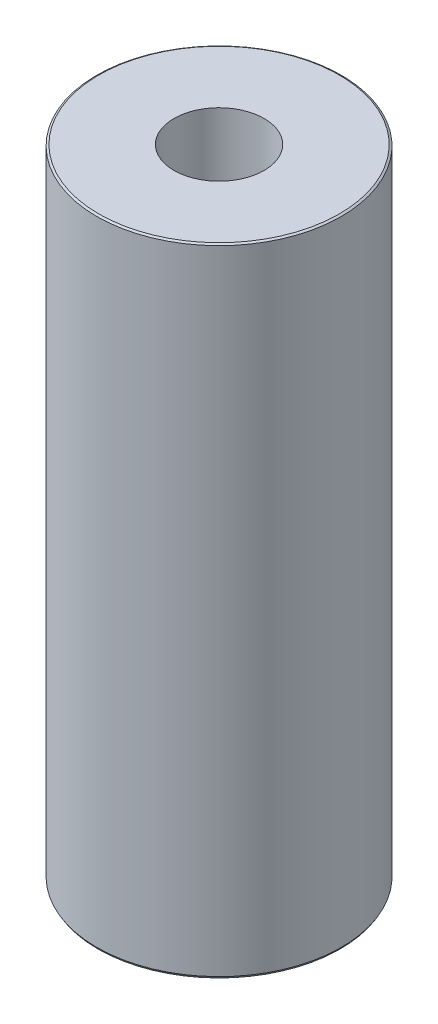
ISO-10303-21;
HEADER;
FILE_DESCRIPTION(('STEP AP214'),'2;1');
FILE_NAME('part.step','',(''),(''),'','','');
FILE_SCHEMA(('AUTOMOTIVE_DESIGN { 1 0 10303 214 1 1 1 1 }'));
ENDSEC;
DATA;
#1=APPLICATION_CONTEXT('core data for automotive mechanical design processes');
#2=APPLICATION_PROTOCOL_DEFINITION('international standard','automotive_design',2000,#1);
#3=PRODUCT_CONTEXT('',#1,'mechanical');
#4=PRODUCT('Part','Part','',(#3));
#5=PRODUCT_RELATED_PRODUCT_CATEGORY('part','',(#4));
#6=PRODUCT_DEFINITION_FORMATION('','',#4);
#7=PRODUCT_DEFINITION_CONTEXT('part definition',#1,'design');
#8=PRODUCT_DEFINITION('design','',#6,#7);
#9=PRODUCT_DEFINITION_SHAPE('','',#8);
#10=(LENGTH_UNIT() NAMED_UNIT(*) SI_UNIT(.MILLI.,.METRE.));
#11=(NAMED_UNIT(*) PLANE_ANGLE_UNIT() SI_UNIT($,.RADIAN.));
#12=(NAMED_UNIT(*) SI_UNIT($,.STERADIAN.) SOLID_ANGLE_UNIT());
#13=UNCERTAINTY_MEASURE_WITH_UNIT(LENGTH_MEASURE(1.E-05),#10,'distance_accuracy_value','');
#14=(GEOMETRIC_REPRESENTATION_CONTEXT(3) GLOBAL_UNCERTAINTY_ASSIGNED_CONTEXT((#13)) GLOBAL_UNIT_ASSIGNED_CONTEXT((#10,
#11,#12)) REPRESENTATION_CONTEXT('',''));
#15=CARTESIAN_POINT('',(0.,0.,0.));
#16=DIRECTION('',(0.,0.,1.));
#17=DIRECTION('',(1.,0.,0.));
#18=AXIS2_PLACEMENT_3D('',#15,#16,#17);
#19=CARTESIAN_POINT('',(0.,117.02335280442,0.));
#20=DIRECTION('',(0.,-1.,0.));
#21=DIRECTION('',(0.,0.,-1.));
#22=AXIS2_PLACEMENT_3D('',#19,#20,#21);
#23=CYLINDRICAL_SURFACE('',#22,22.5);
#24=CARTESIAN_POINT('',(0.,116.809439046885,0.));
#25=DIRECTION('',(0.,1.,0.));
#26=DIRECTION('',(0.,0.,1.));
#27=AXIS2_PLACEMENT_3D('',#24,#25,#26);
#28=CIRCLE('',#27,22.5);
#29=CARTESIAN_POINT('',(0.,116.809439046885,22.5));
#30=VERTEX_POINT('',#29);
#31=EDGE_CURVE('E50',#30,#30,#28,.F.);
#32=ORIENTED_EDGE('',*,*,#31,.T.);
#33=EDGE_LOOP('',(#32));
#34=FACE_BOUND('',#33,.T.);
#35=CARTESIAN_POINT('',(0.,0.370509496488577,0.));
#36=DIRECTION('',(0.,1.,0.));
#37=DIRECTION('',(0.,0.,1.));
#38=AXIS2_PLACEMENT_3D('',#35,#36,#37);
#39=CIRCLE('',#38,22.5);
#40=CARTESIAN_POINT('',(0.,0.370509496488577,22.5));
#41=VERTEX_POINT('',#40);
#42=EDGE_CURVE('E51',#41,#41,#39,.T.);
#43=ORIENTED_EDGE('',*,*,#42,.T.);
#44=EDGE_LOOP('',(#43));
#45=FACE_BOUND('',#44,.T.);
#46=ADVANCED_FACE('F39',(#34,#45),#23,.T.);
#47=CARTESIAN_POINT('',(0.,117.02335280442,0.));
#48=DIRECTION('',(0.,1.,0.));
#49=DIRECTION('',(0.,0.,1.));
#50=AXIS2_PLACEMENT_3D('',#47,#48,#49);
#51=PLANE('',#50);
#52=CARTESIAN_POINT('',(0.,117.02335280442,0.));
#53=DIRECTION('',(0.,1.,0.));
#54=DIRECTION('',(0.,0.,1.));
#55=AXIS2_PLACEMENT_3D('',#52,#53,#54);
#56=CIRCLE('',#55,22.1294905035114);
#57=CARTESIAN_POINT('',(0.,117.02335280442,22.1294905035114));
#58=VERTEX_POINT('',#57);
#59=EDGE_CURVE('E54',#58,#58,#56,.T.);
#60=ORIENTED_EDGE('',*,*,#59,.T.);
#61=EDGE_LOOP('',(#60));
#62=FACE_BOUND('',#61,.T.);
#63=CARTESIAN_POINT('',(0.,117.02335280442,0.));
#64=DIRECTION('',(0.,1.,0.));
#65=DIRECTION('',(0.,0.,1.));
#66=AXIS2_PLACEMENT_3D('',#63,#64,#65);
#67=CIRCLE('',#66,8.28790664441514);
#68=CARTESIAN_POINT('',(0.,117.02335280442,8.28790664441514));
#69=VERTEX_POINT('',#68);
#70=EDGE_CURVE('E58',#69,#69,#67,.T.);
#71=ORIENTED_EDGE('',*,*,#70,.F.);
#72=EDGE_LOOP('',(#71));
#73=FACE_BOUND('',#72,.T.);
#74=ADVANCED_FACE('F69',(#62,#73),#51,.T.);
#75=CARTESIAN_POINT('',(0.,0.,0.));
#76=DIRECTION('',(0.,1.,0.));
#77=DIRECTION('',(0.,0.,1.));
#78=AXIS2_PLACEMENT_3D('',#75,#76,#77);
#79=PLANE('',#78);
#80=CARTESIAN_POINT('',(0.,0.,0.));
#81=DIRECTION('',(0.,1.,0.));
#82=DIRECTION('',(0.,0.,1.));
#83=AXIS2_PLACEMENT_3D('',#80,#81,#82);
#84=CIRCLE('',#83,22.286086242465);
#85=CARTESIAN_POINT('',(0.,0.,22.286086242465));
#86=VERTEX_POINT('',#85);
#87=EDGE_CURVE('E10',#86,#86,#84,.F.);
#88=ORIENTED_EDGE('',*,*,#87,.T.);
#89=EDGE_LOOP('',(#88));
#90=FACE_BOUND('',#89,.T.);
#91=CARTESIAN_POINT('',(0.,0.,0.));
#92=DIRECTION('',(0.,1.,0.));
#93=DIRECTION('',(0.,0.,1.));
#94=AXIS2_PLACEMENT_3D('',#91,#92,#93);
#95=CIRCLE('',#94,8.28790664441514);
#96=CARTESIAN_POINT('',(0.,0.,8.28790664441514));
#97=VERTEX_POINT('',#96);
#98=EDGE_CURVE('E63',#97,#97,#95,.T.);
#99=ORIENTED_EDGE('',*,*,#98,.T.);
#100=EDGE_LOOP('',(#99));
#101=FACE_BOUND('',#100,.T.);
#102=ADVANCED_FACE('F75',(#90,#101),#79,.F.);
#103=CARTESIAN_POINT('',(0.,117.02335280442,0.));
#104=DIRECTION('',(0.,-1.,0.));
#105=DIRECTION('',(0.,0.,-1.));
#106=AXIS2_PLACEMENT_3D('',#103,#104,#105);
#107=CYLINDRICAL_SURFACE('',#106,8.28790664441514);
#108=ORIENTED_EDGE('',*,*,#70,.T.);
#109=EDGE_LOOP('',(#108));
#110=FACE_BOUND('',#109,.T.);
#111=ORIENTED_EDGE('',*,*,#98,.F.);
#112=EDGE_LOOP('',(#111));
#113=FACE_BOUND('',#112,.T.);
#114=ADVANCED_FACE('F70',(#110,#113),#107,.F.);
#115=CARTESIAN_POINT('',(0.,117.02335280442,0.));
#116=DIRECTION('',(0.,-1.,0.));
#117=DIRECTION('',(0.,0.,-1.));
#118=AXIS2_PLACEMENT_3D('',#115,#116,#117);
#119=CONICAL_SURFACE('',#118,22.1294905035114,1.04719755119661);
#120=ORIENTED_EDGE('',*,*,#31,.F.);
#121=EDGE_LOOP('',(#120));
#122=FACE_BOUND('',#121,.T.);
#123=ORIENTED_EDGE('',*,*,#59,.F.);
#124=EDGE_LOOP('',(#123));
#125=FACE_BOUND('',#124,.T.);
#126=ADVANCED_FACE('F81',(#122,#125),#119,.T.);
#127=CARTESIAN_POINT('',(0.,0.370509496488577,0.));
#128=DIRECTION('',(0.,1.,0.));
#129=DIRECTION('',(0.,0.,1.));
#130=AXIS2_PLACEMENT_3D('',#127,#128,#129);
#131=CONICAL_SURFACE('',#130,22.5,0.523598775598298);
#132=ORIENTED_EDGE('',*,*,#87,.F.);
#133=EDGE_LOOP('',(#132));
#134=FACE_BOUND('',#133,.T.);
#135=ORIENTED_EDGE('',*,*,#42,.F.);
#136=EDGE_LOOP('',(#135));
#137=FACE_BOUND('',#136,.T.);
#138=ADVANCED_FACE('F45',(#134,#137),#131,.T.);
#139=CLOSED_SHELL('',(#46,#74,#102,#114,#126,#138));
#140=MANIFOLD_SOLID_BREP('B2',#139);
#141=ADVANCED_BREP_SHAPE_REPRESENTATION('',(#18,#140),#14);
#142=SHAPE_DEFINITION_REPRESENTATION(#9,#141);
ENDSEC;
END-ISO-10303-21;
